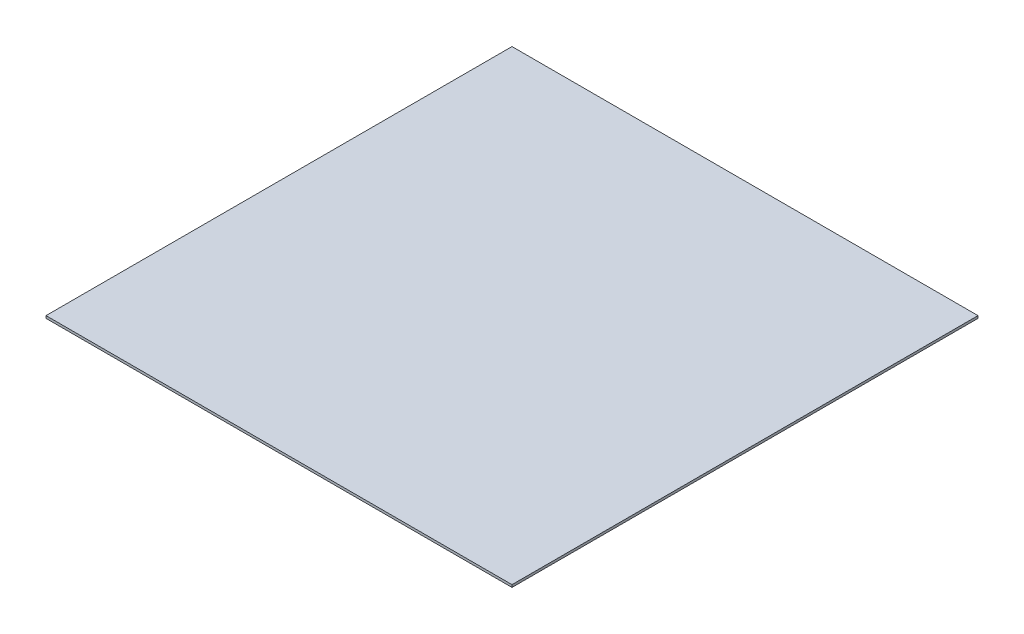
ISO-10303-21;
HEADER;
FILE_DESCRIPTION(('STEP AP214'),'2;1');
FILE_NAME('part.step','',(''),(''),'','','');
FILE_SCHEMA(('AUTOMOTIVE_DESIGN { 1 0 10303 214 1 1 1 1 }'));
ENDSEC;
DATA;
#1=APPLICATION_CONTEXT('core data for automotive mechanical design processes');
#2=APPLICATION_PROTOCOL_DEFINITION('international standard','automotive_design',2000,#1);
#3=PRODUCT_CONTEXT('',#1,'mechanical');
#4=PRODUCT('Part','Part','',(#3));
#5=PRODUCT_RELATED_PRODUCT_CATEGORY('part','',(#4));
#6=PRODUCT_DEFINITION_FORMATION('','',#4);
#7=PRODUCT_DEFINITION_CONTEXT('part definition',#1,'design');
#8=PRODUCT_DEFINITION('design','',#6,#7);
#9=PRODUCT_DEFINITION_SHAPE('','',#8);
#10=(LENGTH_UNIT() NAMED_UNIT(*) SI_UNIT(.MILLI.,.METRE.));
#11=(NAMED_UNIT(*) PLANE_ANGLE_UNIT() SI_UNIT($,.RADIAN.));
#12=(NAMED_UNIT(*) SI_UNIT($,.STERADIAN.) SOLID_ANGLE_UNIT());
#13=UNCERTAINTY_MEASURE_WITH_UNIT(LENGTH_MEASURE(1.E-05),#10,'distance_accuracy_value','');
#14=(GEOMETRIC_REPRESENTATION_CONTEXT(3) GLOBAL_UNCERTAINTY_ASSIGNED_CONTEXT((#13)) GLOBAL_UNIT_ASSIGNED_CONTEXT((#10,
#11,#12)) REPRESENTATION_CONTEXT('',''));
#15=CARTESIAN_POINT('',(0.,0.,0.));
#16=DIRECTION('',(0.,0.,1.));
#17=DIRECTION('',(1.,0.,0.));
#18=AXIS2_PLACEMENT_3D('',#15,#16,#17);
#19=CARTESIAN_POINT('',(-304.8,-3.175,-304.8));
#20=DIRECTION('',(-1.,0.,0.));
#21=DIRECTION('',(0.,0.,1.));
#22=AXIS2_PLACEMENT_3D('',#19,#20,#21);
#23=PLANE('',#22);
#24=DIRECTION('',(0.,0.,1.));
#25=VECTOR('',#24,1.);
#26=CARTESIAN_POINT('',(-304.8,0.,-304.8));
#27=LINE('',#26,#25);
#28=CARTESIAN_POINT('',(-304.8,0.,-304.8));
#29=VERTEX_POINT('',#28);
#30=CARTESIAN_POINT('',(-304.8,0.,304.8));
#31=VERTEX_POINT('',#30);
#32=EDGE_CURVE('E400',#29,#31,#27,.T.);
#33=ORIENTED_EDGE('',*,*,#32,.F.);
#34=DIRECTION('',(0.,1.,0.));
#35=VECTOR('',#34,1.);
#36=CARTESIAN_POINT('',(-304.8,-3.175,-304.8));
#37=LINE('',#36,#35);
#38=CARTESIAN_POINT('',(-304.8,-3.175,-304.8));
#39=VERTEX_POINT('',#38);
#40=EDGE_CURVE('E11',#39,#29,#37,.T.);
#41=ORIENTED_EDGE('',*,*,#40,.F.);
#42=DIRECTION('',(0.,0.,1.));
#43=VECTOR('',#42,1.);
#44=CARTESIAN_POINT('',(-304.8,-3.175,-304.8));
#45=LINE('',#44,#43);
#46=CARTESIAN_POINT('',(-304.8,-3.175,304.8));
#47=VERTEX_POINT('',#46);
#48=EDGE_CURVE('E402',#39,#47,#45,.T.);
#49=ORIENTED_EDGE('',*,*,#48,.T.);
#50=DIRECTION('',(0.,1.,0.));
#51=VECTOR('',#50,1.);
#52=CARTESIAN_POINT('',(-304.8,-3.175,304.8));
#53=LINE('',#52,#51);
#54=EDGE_CURVE('E363',#47,#31,#53,.T.);
#55=ORIENTED_EDGE('',*,*,#54,.T.);
#56=EDGE_LOOP('',(#33,#41,#49,#55));
#57=FACE_BOUND('',#56,.T.);
#58=ADVANCED_FACE('F360',(#57),#23,.T.);
#59=CARTESIAN_POINT('',(-304.8,-3.175,-304.8));
#60=DIRECTION('',(0.,0.,-1.));
#61=DIRECTION('',(-1.,0.,0.));
#62=AXIS2_PLACEMENT_3D('',#59,#60,#61);
#63=PLANE('',#62);
#64=DIRECTION('',(-1.,0.,0.));
#65=VECTOR('',#64,1.);
#66=CARTESIAN_POINT('',(-304.8,0.,-304.8));
#67=LINE('',#66,#65);
#68=CARTESIAN_POINT('',(304.8,0.,-304.8));
#69=VERTEX_POINT('',#68);
#70=EDGE_CURVE('E417',#69,#29,#67,.T.);
#71=ORIENTED_EDGE('',*,*,#70,.F.);
#72=DIRECTION('',(0.,1.,0.));
#73=VECTOR('',#72,1.);
#74=CARTESIAN_POINT('',(304.8,-3.175,-304.8));
#75=LINE('',#74,#73);
#76=CARTESIAN_POINT('',(304.8,-3.175,-304.8));
#77=VERTEX_POINT('',#76);
#78=EDGE_CURVE('E368',#77,#69,#75,.T.);
#79=ORIENTED_EDGE('',*,*,#78,.F.);
#80=DIRECTION('',(-1.,0.,0.));
#81=VECTOR('',#80,1.);
#82=CARTESIAN_POINT('',(-304.8,-3.175,-304.8));
#83=LINE('',#82,#81);
#84=EDGE_CURVE('E407',#77,#39,#83,.T.);
#85=ORIENTED_EDGE('',*,*,#84,.T.);
#86=ORIENTED_EDGE('',*,*,#40,.T.);
#87=EDGE_LOOP('',(#71,#79,#85,#86));
#88=FACE_BOUND('',#87,.T.);
#89=ADVANCED_FACE('F432',(#88),#63,.T.);
#90=CARTESIAN_POINT('',(304.8,-3.175,-304.8));
#91=DIRECTION('',(1.,0.,0.));
#92=DIRECTION('',(0.,0.,-1.));
#93=AXIS2_PLACEMENT_3D('',#90,#91,#92);
#94=PLANE('',#93);
#95=DIRECTION('',(0.,0.,-1.));
#96=VECTOR('',#95,1.);
#97=CARTESIAN_POINT('',(304.8,0.,-304.8));
#98=LINE('',#97,#96);
#99=CARTESIAN_POINT('',(304.8,0.,304.8));
#100=VERTEX_POINT('',#99);
#101=EDGE_CURVE('E414',#100,#69,#98,.T.);
#102=ORIENTED_EDGE('',*,*,#101,.F.);
#103=DIRECTION('',(0.,1.,0.));
#104=VECTOR('',#103,1.);
#105=CARTESIAN_POINT('',(304.8,-3.175,304.8));
#106=LINE('',#105,#104);
#107=CARTESIAN_POINT('',(304.8,-3.175,304.8));
#108=VERTEX_POINT('',#107);
#109=EDGE_CURVE('E406',#108,#100,#106,.T.);
#110=ORIENTED_EDGE('',*,*,#109,.F.);
#111=DIRECTION('',(0.,0.,-1.));
#112=VECTOR('',#111,1.);
#113=CARTESIAN_POINT('',(304.8,-3.175,-304.8));
#114=LINE('',#113,#112);
#115=EDGE_CURVE('E425',#108,#77,#114,.T.);
#116=ORIENTED_EDGE('',*,*,#115,.T.);
#117=ORIENTED_EDGE('',*,*,#78,.T.);
#118=EDGE_LOOP('',(#102,#110,#116,#117));
#119=FACE_BOUND('',#118,.T.);
#120=ADVANCED_FACE('F429',(#119),#94,.T.);
#121=CARTESIAN_POINT('',(-304.8,-3.175,304.8));
#122=DIRECTION('',(0.,0.,1.));
#123=DIRECTION('',(1.,0.,0.));
#124=AXIS2_PLACEMENT_3D('',#121,#122,#123);
#125=PLANE('',#124);
#126=DIRECTION('',(1.,0.,0.));
#127=VECTOR('',#126,1.);
#128=CARTESIAN_POINT('',(-304.8,0.,304.8));
#129=LINE('',#128,#127);
#130=EDGE_CURVE('E409',#31,#100,#129,.T.);
#131=ORIENTED_EDGE('',*,*,#130,.F.);
#132=ORIENTED_EDGE('',*,*,#54,.F.);
#133=DIRECTION('',(1.,0.,0.));
#134=VECTOR('',#133,1.);
#135=CARTESIAN_POINT('',(-304.8,-3.175,304.8));
#136=LINE('',#135,#134);
#137=EDGE_CURVE('E423',#47,#108,#136,.T.);
#138=ORIENTED_EDGE('',*,*,#137,.T.);
#139=ORIENTED_EDGE('',*,*,#109,.T.);
#140=EDGE_LOOP('',(#131,#132,#138,#139));
#141=FACE_BOUND('',#140,.T.);
#142=ADVANCED_FACE('F410',(#141),#125,.T.);
#143=CARTESIAN_POINT('',(-304.8,-3.175,304.8));
#144=DIRECTION('',(0.,1.,0.));
#145=DIRECTION('',(0.,0.,1.));
#146=AXIS2_PLACEMENT_3D('',#143,#144,#145);
#147=PLANE('',#146);
#148=ORIENTED_EDGE('',*,*,#48,.F.);
#149=ORIENTED_EDGE('',*,*,#84,.F.);
#150=ORIENTED_EDGE('',*,*,#115,.F.);
#151=ORIENTED_EDGE('',*,*,#137,.F.);
#152=EDGE_LOOP('',(#148,#149,#150,#151));
#153=FACE_BOUND('',#152,.T.);
#154=ADVANCED_FACE('F434',(#153),#147,.F.);
#155=CARTESIAN_POINT('',(-304.8,0.,304.8));
#156=DIRECTION('',(0.,1.,0.));
#157=DIRECTION('',(0.,0.,1.));
#158=AXIS2_PLACEMENT_3D('',#155,#156,#157);
#159=PLANE('',#158);
#160=ORIENTED_EDGE('',*,*,#32,.T.);
#161=ORIENTED_EDGE('',*,*,#130,.T.);
#162=ORIENTED_EDGE('',*,*,#101,.T.);
#163=ORIENTED_EDGE('',*,*,#70,.T.);
#164=EDGE_LOOP('',(#160,#161,#162,#163));
#165=FACE_BOUND('',#164,.T.);
#166=ADVANCED_FACE('F416',(#165),#159,.T.);
#167=CLOSED_SHELL('',(#58,#89,#120,#142,#154,#166));
#168=MANIFOLD_SOLID_BREP('B2',#167);
#169=ADVANCED_BREP_SHAPE_REPRESENTATION('',(#18,#168),#14);
#170=SHAPE_DEFINITION_REPRESENTATION(#9,#169);
ENDSEC;
END-ISO-10303-21;
